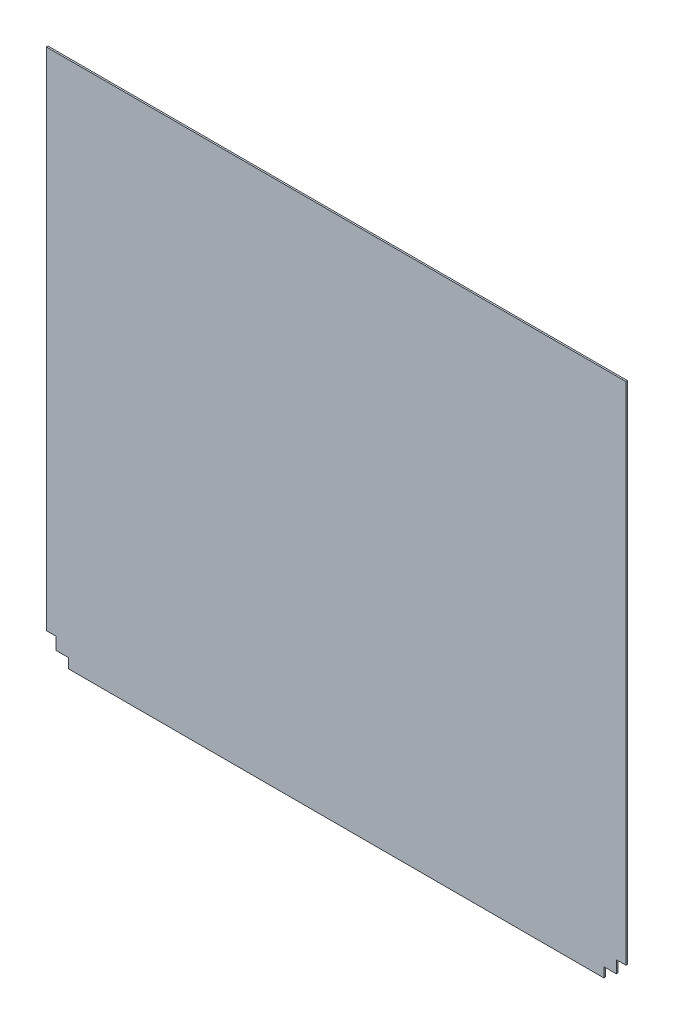
ISO-10303-21;
HEADER;
FILE_DESCRIPTION(('STEP AP214'),'2;1');
FILE_NAME('part.step','',(''),(''),'','','');
FILE_SCHEMA(('AUTOMOTIVE_DESIGN { 1 0 10303 214 1 1 1 1 }'));
ENDSEC;
DATA;
#1=APPLICATION_CONTEXT('core data for automotive mechanical design processes');
#2=APPLICATION_PROTOCOL_DEFINITION('international standard','automotive_design',2000,#1);
#3=PRODUCT_CONTEXT('',#1,'mechanical');
#4=PRODUCT('Part','Part','',(#3));
#5=PRODUCT_RELATED_PRODUCT_CATEGORY('part','',(#4));
#6=PRODUCT_DEFINITION_FORMATION('','',#4);
#7=PRODUCT_DEFINITION_CONTEXT('part definition',#1,'design');
#8=PRODUCT_DEFINITION('design','',#6,#7);
#9=PRODUCT_DEFINITION_SHAPE('','',#8);
#10=(LENGTH_UNIT() NAMED_UNIT(*) SI_UNIT(.MILLI.,.METRE.));
#11=(NAMED_UNIT(*) PLANE_ANGLE_UNIT() SI_UNIT($,.RADIAN.));
#12=(NAMED_UNIT(*) SI_UNIT($,.STERADIAN.) SOLID_ANGLE_UNIT());
#13=UNCERTAINTY_MEASURE_WITH_UNIT(LENGTH_MEASURE(1.E-05),#10,'distance_accuracy_value','');
#14=(GEOMETRIC_REPRESENTATION_CONTEXT(3) GLOBAL_UNCERTAINTY_ASSIGNED_CONTEXT((#13)) GLOBAL_UNIT_ASSIGNED_CONTEXT((#10,
#11,#12)) REPRESENTATION_CONTEXT('',''));
#15=CARTESIAN_POINT('',(0.,0.,0.));
#16=DIRECTION('',(0.,0.,1.));
#17=DIRECTION('',(1.,0.,0.));
#18=AXIS2_PLACEMENT_3D('',#15,#16,#17);
#19=CARTESIAN_POINT('',(872.45698,0.,2.54));
#20=DIRECTION('',(1.,0.,0.));
#21=DIRECTION('',(0.,0.,-1.));
#22=AXIS2_PLACEMENT_3D('',#19,#20,#21);
#23=PLANE('',#22);
#24=DIRECTION('',(0.,-1.,0.));
#25=VECTOR('',#24,1.);
#26=CARTESIAN_POINT('',(872.45698,0.,0.));
#27=LINE('',#26,#25);
#28=CARTESIAN_POINT('',(872.45698,15.24,0.));
#29=VERTEX_POINT('',#28);
#30=CARTESIAN_POINT('',(872.45698,0.,0.));
#31=VERTEX_POINT('',#30);
#32=EDGE_CURVE('E168',#29,#31,#27,.T.);
#33=ORIENTED_EDGE('',*,*,#32,.F.);
#34=DIRECTION('',(0.,0.,-1.));
#35=VECTOR('',#34,1.);
#36=CARTESIAN_POINT('',(872.45698,15.24,2.54));
#37=LINE('',#36,#35);
#38=CARTESIAN_POINT('',(872.45698,15.24,2.54));
#39=VERTEX_POINT('',#38);
#40=EDGE_CURVE('E11',#39,#29,#37,.T.);
#41=ORIENTED_EDGE('',*,*,#40,.F.);
#42=DIRECTION('',(0.,-1.,0.));
#43=VECTOR('',#42,1.);
#44=CARTESIAN_POINT('',(872.45698,0.,2.54));
#45=LINE('',#44,#43);
#46=CARTESIAN_POINT('',(872.45698,0.,2.54));
#47=VERTEX_POINT('',#46);
#48=EDGE_CURVE('E209',#39,#47,#45,.T.);
#49=ORIENTED_EDGE('',*,*,#48,.T.);
#50=DIRECTION('',(0.,0.,-1.));
#51=VECTOR('',#50,1.);
#52=CARTESIAN_POINT('',(872.45698,0.,2.54));
#53=LINE('',#52,#51);
#54=EDGE_CURVE('E111',#47,#31,#53,.T.);
#55=ORIENTED_EDGE('',*,*,#54,.T.);
#56=EDGE_LOOP('',(#33,#41,#49,#55));
#57=FACE_BOUND('',#56,.T.);
#58=ADVANCED_FACE('F47',(#57),#23,.T.);
#59=CARTESIAN_POINT('',(0.,15.2399999999999,2.54));
#60=DIRECTION('',(0.,-1.,0.));
#61=DIRECTION('',(1.,0.,0.));
#62=AXIS2_PLACEMENT_3D('',#59,#60,#61);
#63=PLANE('',#62);
#64=DIRECTION('',(-1.,0.,0.));
#65=VECTOR('',#64,1.);
#66=CARTESIAN_POINT('',(0.,15.2399999999999,0.));
#67=LINE('',#66,#65);
#68=CARTESIAN_POINT('',(891.76098,15.24,0.));
#69=VERTEX_POINT('',#68);
#70=EDGE_CURVE('E172',#69,#29,#67,.T.);
#71=ORIENTED_EDGE('',*,*,#70,.F.);
#72=DIRECTION('',(0.,0.,-1.));
#73=VECTOR('',#72,1.);
#74=CARTESIAN_POINT('',(891.76098,15.24,2.54));
#75=LINE('',#74,#73);
#76=CARTESIAN_POINT('',(891.76098,15.24,2.54));
#77=VERTEX_POINT('',#76);
#78=EDGE_CURVE('E56',#77,#69,#75,.T.);
#79=ORIENTED_EDGE('',*,*,#78,.F.);
#80=DIRECTION('',(-1.,0.,0.));
#81=VECTOR('',#80,1.);
#82=CARTESIAN_POINT('',(0.,15.2399999999999,2.54));
#83=LINE('',#82,#81);
#84=EDGE_CURVE('E256',#77,#39,#83,.T.);
#85=ORIENTED_EDGE('',*,*,#84,.T.);
#86=ORIENTED_EDGE('',*,*,#40,.T.);
#87=EDGE_LOOP('',(#71,#79,#85,#86));
#88=FACE_BOUND('',#87,.T.);
#89=ADVANCED_FACE('F245',(#88),#63,.T.);
#90=CARTESIAN_POINT('',(891.76098,0.,2.54));
#91=DIRECTION('',(1.,0.,0.));
#92=DIRECTION('',(0.,0.,-1.));
#93=AXIS2_PLACEMENT_3D('',#90,#91,#92);
#94=PLANE('',#93);
#95=DIRECTION('',(0.,-1.,0.));
#96=VECTOR('',#95,1.);
#97=CARTESIAN_POINT('',(891.76098,0.,0.));
#98=LINE('',#97,#96);
#99=CARTESIAN_POINT('',(891.76098,34.544,0.));
#100=VERTEX_POINT('',#99);
#101=EDGE_CURVE('E176',#100,#69,#98,.T.);
#102=ORIENTED_EDGE('',*,*,#101,.F.);
#103=DIRECTION('',(0.,0.,-1.));
#104=VECTOR('',#103,1.);
#105=CARTESIAN_POINT('',(891.76098,34.544,2.54));
#106=LINE('',#105,#104);
#107=CARTESIAN_POINT('',(891.76098,34.544,2.54));
#108=VERTEX_POINT('',#107);
#109=EDGE_CURVE('E232',#108,#100,#106,.T.);
#110=ORIENTED_EDGE('',*,*,#109,.F.);
#111=DIRECTION('',(0.,-1.,0.));
#112=VECTOR('',#111,1.);
#113=CARTESIAN_POINT('',(891.76098,0.,2.54));
#114=LINE('',#113,#112);
#115=EDGE_CURVE('E241',#108,#77,#114,.T.);
#116=ORIENTED_EDGE('',*,*,#115,.T.);
#117=ORIENTED_EDGE('',*,*,#78,.T.);
#118=EDGE_LOOP('',(#102,#110,#116,#117));
#119=FACE_BOUND('',#118,.T.);
#120=ADVANCED_FACE('F239',(#119),#94,.T.);
#121=CARTESIAN_POINT('',(0.,34.5439999999996,2.54));
#122=DIRECTION('',(0.,-1.,0.));
#123=DIRECTION('',(1.,0.,0.));
#124=AXIS2_PLACEMENT_3D('',#121,#122,#123);
#125=PLANE('',#124);
#126=DIRECTION('',(-1.,0.,0.));
#127=VECTOR('',#126,1.);
#128=CARTESIAN_POINT('',(0.,34.5439999999996,0.));
#129=LINE('',#128,#127);
#130=CARTESIAN_POINT('',(907.00098,34.544,0.));
#131=VERTEX_POINT('',#130);
#132=EDGE_CURVE('E180',#131,#100,#129,.T.);
#133=ORIENTED_EDGE('',*,*,#132,.F.);
#134=DIRECTION('',(0.,0.,-1.));
#135=VECTOR('',#134,1.);
#136=CARTESIAN_POINT('',(907.00098,34.544,2.54));
#137=LINE('',#136,#135);
#138=CARTESIAN_POINT('',(907.00098,34.544,2.54));
#139=VERTEX_POINT('',#138);
#140=EDGE_CURVE('E229',#139,#131,#137,.T.);
#141=ORIENTED_EDGE('',*,*,#140,.F.);
#142=DIRECTION('',(-1.,0.,0.));
#143=VECTOR('',#142,1.);
#144=CARTESIAN_POINT('',(0.,34.5439999999996,2.54));
#145=LINE('',#144,#143);
#146=EDGE_CURVE('E255',#139,#108,#145,.T.);
#147=ORIENTED_EDGE('',*,*,#146,.T.);
#148=ORIENTED_EDGE('',*,*,#109,.T.);
#149=EDGE_LOOP('',(#133,#141,#147,#148));
#150=FACE_BOUND('',#149,.T.);
#151=ADVANCED_FACE('F251',(#150),#125,.T.);
#152=CARTESIAN_POINT('',(907.00098,0.,2.54));
#153=DIRECTION('',(-1.,0.,0.));
#154=DIRECTION('',(0.,0.,1.));
#155=AXIS2_PLACEMENT_3D('',#152,#153,#154);
#156=PLANE('',#155);
#157=DIRECTION('',(0.,1.,0.));
#158=VECTOR('',#157,1.);
#159=CARTESIAN_POINT('',(907.00098,0.,0.));
#160=LINE('',#159,#158);
#161=CARTESIAN_POINT('',(907.00098,825.5,0.));
#162=VERTEX_POINT('',#161);
#163=EDGE_CURVE('E184',#131,#162,#160,.T.);
#164=ORIENTED_EDGE('',*,*,#163,.T.);
#165=DIRECTION('',(0.,0.,-1.));
#166=VECTOR('',#165,1.);
#167=CARTESIAN_POINT('',(907.00098,825.5,2.54));
#168=LINE('',#167,#166);
#169=CARTESIAN_POINT('',(907.00098,825.5,2.54));
#170=VERTEX_POINT('',#169);
#171=EDGE_CURVE('E226',#170,#162,#168,.T.);
#172=ORIENTED_EDGE('',*,*,#171,.F.);
#173=DIRECTION('',(0.,1.,0.));
#174=VECTOR('',#173,1.);
#175=CARTESIAN_POINT('',(907.00098,0.,2.54));
#176=LINE('',#175,#174);
#177=EDGE_CURVE('E261',#139,#170,#176,.T.);
#178=ORIENTED_EDGE('',*,*,#177,.F.);
#179=ORIENTED_EDGE('',*,*,#140,.T.);
#180=EDGE_LOOP('',(#164,#172,#178,#179));
#181=FACE_BOUND('',#180,.T.);
#182=ADVANCED_FACE('F304',(#181),#156,.F.);
#183=CARTESIAN_POINT('',(0.,825.5,2.54));
#184=DIRECTION('',(0.,1.,0.));
#185=DIRECTION('',(0.,0.,1.));
#186=AXIS2_PLACEMENT_3D('',#183,#184,#185);
#187=PLANE('',#186);
#188=DIRECTION('',(1.,0.,0.));
#189=VECTOR('',#188,1.);
#190=CARTESIAN_POINT('',(0.,825.5,0.));
#191=LINE('',#190,#189);
#192=CARTESIAN_POINT('',(0.,825.5,0.));
#193=VERTEX_POINT('',#192);
#194=EDGE_CURVE('E188',#193,#162,#191,.T.);
#195=ORIENTED_EDGE('',*,*,#194,.F.);
#196=DIRECTION('',(0.,0.,-1.));
#197=VECTOR('',#196,1.);
#198=CARTESIAN_POINT('',(0.,825.5,2.54));
#199=LINE('',#198,#197);
#200=CARTESIAN_POINT('',(0.,825.5,2.54));
#201=VERTEX_POINT('',#200);
#202=EDGE_CURVE('E223',#201,#193,#199,.T.);
#203=ORIENTED_EDGE('',*,*,#202,.F.);
#204=DIRECTION('',(1.,0.,0.));
#205=VECTOR('',#204,1.);
#206=CARTESIAN_POINT('',(0.,825.5,2.54));
#207=LINE('',#206,#205);
#208=EDGE_CURVE('E268',#201,#170,#207,.T.);
#209=ORIENTED_EDGE('',*,*,#208,.T.);
#210=ORIENTED_EDGE('',*,*,#171,.T.);
#211=EDGE_LOOP('',(#195,#203,#209,#210));
#212=FACE_BOUND('',#211,.T.);
#213=ADVANCED_FACE('F307',(#212),#187,.T.);
#214=CARTESIAN_POINT('',(0.,0.,2.54));
#215=DIRECTION('',(-1.,0.,0.));
#216=DIRECTION('',(0.,0.,1.));
#217=AXIS2_PLACEMENT_3D('',#214,#215,#216);
#218=PLANE('',#217);
#219=DIRECTION('',(0.,1.,0.));
#220=VECTOR('',#219,1.);
#221=CARTESIAN_POINT('',(0.,0.,0.));
#222=LINE('',#221,#220);
#223=CARTESIAN_POINT('',(0.,34.544,0.));
#224=VERTEX_POINT('',#223);
#225=EDGE_CURVE('E192',#224,#193,#222,.T.);
#226=ORIENTED_EDGE('',*,*,#225,.F.);
#227=DIRECTION('',(0.,0.,-1.));
#228=VECTOR('',#227,1.);
#229=CARTESIAN_POINT('',(0.,34.544,2.54));
#230=LINE('',#229,#228);
#231=CARTESIAN_POINT('',(0.,34.544,2.54));
#232=VERTEX_POINT('',#231);
#233=EDGE_CURVE('E220',#232,#224,#230,.T.);
#234=ORIENTED_EDGE('',*,*,#233,.F.);
#235=DIRECTION('',(0.,1.,0.));
#236=VECTOR('',#235,1.);
#237=CARTESIAN_POINT('',(0.,0.,2.54));
#238=LINE('',#237,#236);
#239=EDGE_CURVE('E272',#232,#201,#238,.T.);
#240=ORIENTED_EDGE('',*,*,#239,.T.);
#241=ORIENTED_EDGE('',*,*,#202,.T.);
#242=EDGE_LOOP('',(#226,#234,#240,#241));
#243=FACE_BOUND('',#242,.T.);
#244=ADVANCED_FACE('F311',(#243),#218,.T.);
#245=CARTESIAN_POINT('',(0.,34.544,2.54));
#246=DIRECTION('',(0.,1.,0.));
#247=DIRECTION('',(0.,0.,1.));
#248=AXIS2_PLACEMENT_3D('',#245,#246,#247);
#249=PLANE('',#248);
#250=DIRECTION('',(1.,0.,0.));
#251=VECTOR('',#250,1.);
#252=CARTESIAN_POINT('',(0.,34.544,0.));
#253=LINE('',#252,#251);
#254=CARTESIAN_POINT('',(15.24,34.544,0.));
#255=VERTEX_POINT('',#254);
#256=EDGE_CURVE('E196',#224,#255,#253,.T.);
#257=ORIENTED_EDGE('',*,*,#256,.T.);
#258=DIRECTION('',(0.,0.,-1.));
#259=VECTOR('',#258,1.);
#260=CARTESIAN_POINT('',(15.24,34.544,2.54));
#261=LINE('',#260,#259);
#262=CARTESIAN_POINT('',(15.24,34.544,2.54));
#263=VERTEX_POINT('',#262);
#264=EDGE_CURVE('E216',#263,#255,#261,.T.);
#265=ORIENTED_EDGE('',*,*,#264,.F.);
#266=DIRECTION('',(1.,0.,0.));
#267=VECTOR('',#266,1.);
#268=CARTESIAN_POINT('',(0.,34.544,2.54));
#269=LINE('',#268,#267);
#270=EDGE_CURVE('E276',#232,#263,#269,.T.);
#271=ORIENTED_EDGE('',*,*,#270,.F.);
#272=ORIENTED_EDGE('',*,*,#233,.T.);
#273=EDGE_LOOP('',(#257,#265,#271,#272));
#274=FACE_BOUND('',#273,.T.);
#275=ADVANCED_FACE('F284',(#274),#249,.F.);
#276=CARTESIAN_POINT('',(15.24,0.,2.54));
#277=DIRECTION('',(1.,0.,0.));
#278=DIRECTION('',(0.,1.,0.));
#279=AXIS2_PLACEMENT_3D('',#276,#277,#278);
#280=PLANE('',#279);
#281=DIRECTION('',(0.,-1.,0.));
#282=VECTOR('',#281,1.);
#283=CARTESIAN_POINT('',(15.24,0.,0.));
#284=LINE('',#283,#282);
#285=CARTESIAN_POINT('',(15.24,15.24,0.));
#286=VERTEX_POINT('',#285);
#287=EDGE_CURVE('E199',#255,#286,#284,.T.);
#288=ORIENTED_EDGE('',*,*,#287,.T.);
#289=DIRECTION('',(0.,0.,-1.));
#290=VECTOR('',#289,1.);
#291=CARTESIAN_POINT('',(15.24,15.24,2.54));
#292=LINE('',#291,#290);
#293=CARTESIAN_POINT('',(15.24,15.24,2.54));
#294=VERTEX_POINT('',#293);
#295=EDGE_CURVE('E158',#294,#286,#292,.T.);
#296=ORIENTED_EDGE('',*,*,#295,.F.);
#297=DIRECTION('',(0.,-1.,0.));
#298=VECTOR('',#297,1.);
#299=CARTESIAN_POINT('',(15.24,0.,2.54));
#300=LINE('',#299,#298);
#301=EDGE_CURVE('E147',#263,#294,#300,.T.);
#302=ORIENTED_EDGE('',*,*,#301,.F.);
#303=ORIENTED_EDGE('',*,*,#264,.T.);
#304=EDGE_LOOP('',(#288,#296,#302,#303));
#305=FACE_BOUND('',#304,.T.);
#306=ADVANCED_FACE('F288',(#305),#280,.F.);
#307=CARTESIAN_POINT('',(0.,15.24,2.54));
#308=DIRECTION('',(0.,1.,0.));
#309=DIRECTION('',(0.,0.,1.));
#310=AXIS2_PLACEMENT_3D('',#307,#308,#309);
#311=PLANE('',#310);
#312=DIRECTION('',(1.,0.,0.));
#313=VECTOR('',#312,1.);
#314=CARTESIAN_POINT('',(0.,15.24,0.));
#315=LINE('',#314,#313);
#316=CARTESIAN_POINT('',(34.544,15.24,0.));
#317=VERTEX_POINT('',#316);
#318=EDGE_CURVE('E156',#286,#317,#315,.T.);
#319=ORIENTED_EDGE('',*,*,#318,.T.);
#320=DIRECTION('',(0.,0.,-1.));
#321=VECTOR('',#320,1.);
#322=CARTESIAN_POINT('',(34.544,15.24,2.54));
#323=LINE('',#322,#321);
#324=CARTESIAN_POINT('',(34.544,15.24,2.54));
#325=VERTEX_POINT('',#324);
#326=EDGE_CURVE('E153',#325,#317,#323,.T.);
#327=ORIENTED_EDGE('',*,*,#326,.F.);
#328=DIRECTION('',(1.,0.,0.));
#329=VECTOR('',#328,1.);
#330=CARTESIAN_POINT('',(0.,15.24,2.54));
#331=LINE('',#330,#329);
#332=EDGE_CURVE('E141',#294,#325,#331,.T.);
#333=ORIENTED_EDGE('',*,*,#332,.F.);
#334=ORIENTED_EDGE('',*,*,#295,.T.);
#335=EDGE_LOOP('',(#319,#327,#333,#334));
#336=FACE_BOUND('',#335,.T.);
#337=ADVANCED_FACE('F154',(#336),#311,.F.);
#338=CARTESIAN_POINT('',(34.544,0.,2.54));
#339=DIRECTION('',(1.,0.,0.));
#340=DIRECTION('',(0.,0.,-1.));
#341=AXIS2_PLACEMENT_3D('',#338,#339,#340);
#342=PLANE('',#341);
#343=DIRECTION('',(0.,-1.,0.));
#344=VECTOR('',#343,1.);
#345=CARTESIAN_POINT('',(34.544,0.,0.));
#346=LINE('',#345,#344);
#347=CARTESIAN_POINT('',(34.544,0.,0.));
#348=VERTEX_POINT('',#347);
#349=EDGE_CURVE('E104',#317,#348,#346,.T.);
#350=ORIENTED_EDGE('',*,*,#349,.T.);
#351=DIRECTION('',(0.,0.,-1.));
#352=VECTOR('',#351,1.);
#353=CARTESIAN_POINT('',(34.544,0.,2.54));
#354=LINE('',#353,#352);
#355=CARTESIAN_POINT('',(34.544,0.,2.54));
#356=VERTEX_POINT('',#355);
#357=EDGE_CURVE('E159',#356,#348,#354,.T.);
#358=ORIENTED_EDGE('',*,*,#357,.F.);
#359=DIRECTION('',(0.,-1.,0.));
#360=VECTOR('',#359,1.);
#361=CARTESIAN_POINT('',(34.544,0.,2.54));
#362=LINE('',#361,#360);
#363=EDGE_CURVE('E145',#325,#356,#362,.T.);
#364=ORIENTED_EDGE('',*,*,#363,.F.);
#365=ORIENTED_EDGE('',*,*,#326,.T.);
#366=EDGE_LOOP('',(#350,#358,#364,#365));
#367=FACE_BOUND('',#366,.T.);
#368=ADVANCED_FACE('F161',(#367),#342,.F.);
#369=CARTESIAN_POINT('',(0.,0.,2.54));
#370=DIRECTION('',(0.,1.,0.));
#371=DIRECTION('',(0.,0.,1.));
#372=AXIS2_PLACEMENT_3D('',#369,#370,#371);
#373=PLANE('',#372);
#374=DIRECTION('',(1.,0.,0.));
#375=VECTOR('',#374,1.);
#376=CARTESIAN_POINT('',(0.,0.,0.));
#377=LINE('',#376,#375);
#378=EDGE_CURVE('E206',#348,#31,#377,.T.);
#379=ORIENTED_EDGE('',*,*,#378,.T.);
#380=ORIENTED_EDGE('',*,*,#54,.F.);
#381=DIRECTION('',(1.,0.,0.));
#382=VECTOR('',#381,1.);
#383=CARTESIAN_POINT('',(0.,0.,2.54));
#384=LINE('',#383,#382);
#385=EDGE_CURVE('E64',#356,#47,#384,.T.);
#386=ORIENTED_EDGE('',*,*,#385,.F.);
#387=ORIENTED_EDGE('',*,*,#357,.T.);
#388=EDGE_LOOP('',(#379,#380,#386,#387));
#389=FACE_BOUND('',#388,.T.);
#390=ADVANCED_FACE('F291',(#389),#373,.F.);
#391=CARTESIAN_POINT('',(0.,0.,2.54));
#392=DIRECTION('',(0.,0.,1.));
#393=DIRECTION('',(1.,0.,0.));
#394=AXIS2_PLACEMENT_3D('',#391,#392,#393);
#395=PLANE('',#394);
#396=ORIENTED_EDGE('',*,*,#48,.F.);
#397=ORIENTED_EDGE('',*,*,#84,.F.);
#398=ORIENTED_EDGE('',*,*,#115,.F.);
#399=ORIENTED_EDGE('',*,*,#146,.F.);
#400=ORIENTED_EDGE('',*,*,#177,.T.);
#401=ORIENTED_EDGE('',*,*,#208,.F.);
#402=ORIENTED_EDGE('',*,*,#239,.F.);
#403=ORIENTED_EDGE('',*,*,#270,.T.);
#404=ORIENTED_EDGE('',*,*,#301,.T.);
#405=ORIENTED_EDGE('',*,*,#332,.T.);
#406=ORIENTED_EDGE('',*,*,#363,.T.);
#407=ORIENTED_EDGE('',*,*,#385,.T.);
#408=EDGE_LOOP('',(#396,#397,#398,#399,#400,#401,#402,#403,#404,#405,#406,#407));
#409=FACE_BOUND('',#408,.T.);
#410=ADVANCED_FACE('F143',(#409),#395,.T.);
#411=CARTESIAN_POINT('',(0.,0.,0.));
#412=DIRECTION('',(0.,0.,1.));
#413=DIRECTION('',(1.,0.,0.));
#414=AXIS2_PLACEMENT_3D('',#411,#412,#413);
#415=PLANE('',#414);
#416=ORIENTED_EDGE('',*,*,#32,.T.);
#417=ORIENTED_EDGE('',*,*,#378,.F.);
#418=ORIENTED_EDGE('',*,*,#349,.F.);
#419=ORIENTED_EDGE('',*,*,#318,.F.);
#420=ORIENTED_EDGE('',*,*,#287,.F.);
#421=ORIENTED_EDGE('',*,*,#256,.F.);
#422=ORIENTED_EDGE('',*,*,#225,.T.);
#423=ORIENTED_EDGE('',*,*,#194,.T.);
#424=ORIENTED_EDGE('',*,*,#163,.F.);
#425=ORIENTED_EDGE('',*,*,#132,.T.);
#426=ORIENTED_EDGE('',*,*,#101,.T.);
#427=ORIENTED_EDGE('',*,*,#70,.T.);
#428=EDGE_LOOP('',(#416,#417,#418,#419,#420,#421,#422,#423,#424,#425,#426,#427));
#429=FACE_BOUND('',#428,.T.);
#430=ADVANCED_FACE('F247',(#429),#415,.F.);
#431=CLOSED_SHELL('',(#58,#89,#120,#151,#182,#213,#244,#275,#306,#337,#368,#390,#410,#430));
#432=MANIFOLD_SOLID_BREP('B2',#431);
#433=ADVANCED_BREP_SHAPE_REPRESENTATION('',(#18,#432),#14);
#434=SHAPE_DEFINITION_REPRESENTATION(#9,#433);
ENDSEC;
END-ISO-10303-21;
